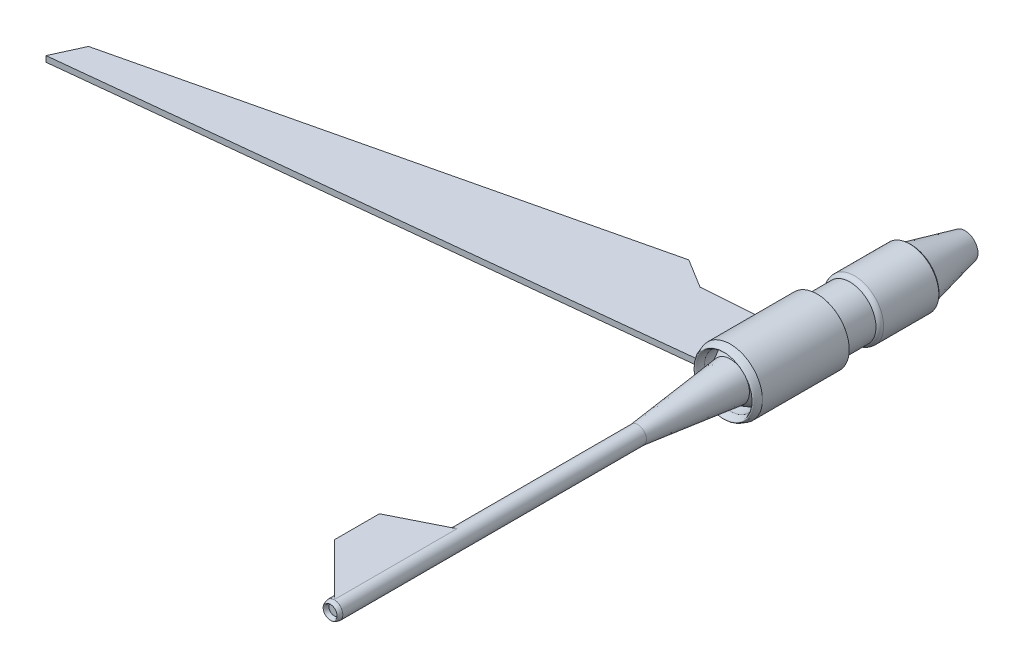
ISO-10303-21;
HEADER;
FILE_DESCRIPTION(('STEP AP214'),'2;1');
FILE_NAME('part.step','',(''),(''),'','','');
FILE_SCHEMA(('AUTOMOTIVE_DESIGN { 1 0 10303 214 1 1 1 1 }'));
ENDSEC;
DATA;
#1=APPLICATION_CONTEXT('core data for automotive mechanical design processes');
#2=APPLICATION_PROTOCOL_DEFINITION('international standard','automotive_design',2000,#1);
#3=PRODUCT_CONTEXT('',#1,'mechanical');
#4=PRODUCT('Part','Part','',(#3));
#5=PRODUCT_RELATED_PRODUCT_CATEGORY('part','',(#4));
#6=PRODUCT_DEFINITION_FORMATION('','',#4);
#7=PRODUCT_DEFINITION_CONTEXT('part definition',#1,'design');
#8=PRODUCT_DEFINITION('design','',#6,#7);
#9=PRODUCT_DEFINITION_SHAPE('','',#8);
#10=(LENGTH_UNIT() NAMED_UNIT(*) SI_UNIT(.MILLI.,.METRE.));
#11=(NAMED_UNIT(*) PLANE_ANGLE_UNIT() SI_UNIT($,.RADIAN.));
#12=(NAMED_UNIT(*) SI_UNIT($,.STERADIAN.) SOLID_ANGLE_UNIT());
#13=UNCERTAINTY_MEASURE_WITH_UNIT(LENGTH_MEASURE(1.E-05),#10,'distance_accuracy_value','');
#14=(GEOMETRIC_REPRESENTATION_CONTEXT(3) GLOBAL_UNCERTAINTY_ASSIGNED_CONTEXT((#13)) GLOBAL_UNIT_ASSIGNED_CONTEXT((#10,
#11,#12)) REPRESENTATION_CONTEXT('',''));
#15=CARTESIAN_POINT('',(0.,0.,0.));
#16=DIRECTION('',(0.,0.,1.));
#17=DIRECTION('',(1.,0.,0.));
#18=AXIS2_PLACEMENT_3D('',#15,#16,#17);
#19=CARTESIAN_POINT('',(0.,0.,-1125.));
#20=DIRECTION('',(0.,0.,1.));
#21=DIRECTION('',(1.,0.,0.));
#22=AXIS2_PLACEMENT_3D('',#19,#20,#21);
#23=CYLINDRICAL_SURFACE('',#22,337.5);
#24=CARTESIAN_POINT('',(0.,0.,-306.632414300902));
#25=DIRECTION('',(0.,0.,1.));
#26=DIRECTION('',(1.,0.,0.));
#27=AXIS2_PLACEMENT_3D('',#24,#25,#26);
#28=CIRCLE('',#27,337.5);
#29=CARTESIAN_POINT('',(337.5,0.,-306.632414300902));
#30=VERTEX_POINT('',#29);
#31=EDGE_CURVE('P0_E26',#30,#30,#28,.F.);
#32=ORIENTED_EDGE('',*,*,#31,.F.);
#33=EDGE_LOOP('',(#32));
#34=FACE_BOUND('',#33,.T.);
#35=CARTESIAN_POINT('',(0.,0.,-1125.));
#36=DIRECTION('',(0.,0.,-1.));
#37=DIRECTION('',(-1.,0.,0.));
#38=AXIS2_PLACEMENT_3D('',#35,#36,#37);
#39=CIRCLE('',#38,337.5);
#40=CARTESIAN_POINT('',(-337.5,0.,-1125.));
#41=VERTEX_POINT('',#40);
#42=EDGE_CURVE('P0_E22',#41,#41,#39,.F.);
#43=ORIENTED_EDGE('',*,*,#42,.F.);
#44=EDGE_LOOP('',(#43));
#45=FACE_BOUND('',#44,.T.);
#46=ADVANCED_FACE('P0_F15',(#34,#45),#23,.F.);
#47=CARTESIAN_POINT('',(0.,0.,0.));
#48=DIRECTION('',(0.,0.,1.));
#49=DIRECTION('',(1.,0.,0.));
#50=AXIS2_PLACEMENT_3D('',#47,#48,#49);
#51=CIRCLE('',#50,337.5);
#52=CARTESIAN_POINT('',(337.5,0.,0.));
#53=VERTEX_POINT('',#52);
#54=EDGE_CURVE('P0_E38',#53,#53,#51,.T.);
#55=ORIENTED_EDGE('',*,*,#54,.T.);
#56=EDGE_LOOP('',(#55));
#57=FACE_BOUND('',#56,.T.);
#58=CARTESIAN_POINT('',(0.,0.,-163.537287627148));
#59=DIRECTION('',(0.,0.,-1.));
#60=DIRECTION('',(-1.,0.,0.));
#61=AXIS2_PLACEMENT_3D('',#58,#59,#60);
#62=CIRCLE('',#61,337.5);
#63=CARTESIAN_POINT('',(-337.5,0.,-163.537287627148));
#64=VERTEX_POINT('',#63);
#65=EDGE_CURVE('P0_E30',#64,#64,#62,.F.);
#66=ORIENTED_EDGE('',*,*,#65,.F.);
#67=EDGE_LOOP('',(#66));
#68=FACE_BOUND('',#67,.T.);
#69=ADVANCED_FACE('P0_F59',(#57,#68),#23,.F.);
#70=CARTESIAN_POINT('',(0.,0.,-1125.));
#71=DIRECTION('',(0.,0.,1.));
#72=DIRECTION('',(1.,0.,0.));
#73=AXIS2_PLACEMENT_3D('',#70,#71,#72);
#74=CYLINDRICAL_SURFACE('',#73,416.25);
#75=CARTESIAN_POINT('',(0.,0.,-1125.));
#76=DIRECTION('',(0.,0.,1.));
#77=DIRECTION('',(1.,0.,0.));
#78=AXIS2_PLACEMENT_3D('',#75,#76,#77);
#79=CIRCLE('',#78,416.25);
#80=CARTESIAN_POINT('',(416.25,0.,-1125.));
#81=VERTEX_POINT('',#80);
#82=EDGE_CURVE('P0_E94',#81,#81,#79,.T.);
#83=ORIENTED_EDGE('',*,*,#82,.T.);
#84=EDGE_LOOP('',(#83));
#85=FACE_BOUND('',#84,.T.);
#86=CARTESIAN_POINT('',(0.,0.,0.));
#87=DIRECTION('',(0.,0.,1.));
#88=DIRECTION('',(1.,0.,0.));
#89=AXIS2_PLACEMENT_3D('',#86,#87,#88);
#90=CIRCLE('',#89,416.25);
#91=CARTESIAN_POINT('',(416.25,0.,0.));
#92=VERTEX_POINT('',#91);
#93=EDGE_CURVE('P0_E35',#92,#92,#90,.T.);
#94=ORIENTED_EDGE('',*,*,#93,.F.);
#95=EDGE_LOOP('',(#94));
#96=FACE_BOUND('',#95,.T.);
#97=ADVANCED_FACE('P0_F17',(#85,#96),#74,.T.);
#98=CARTESIAN_POINT('',(0.,416.25,0.));
#99=CARTESIAN_POINT('',(0.,376.875,180.));
#100=CARTESIAN_POINT('',(0.,337.5,0.));
#101=B_SPLINE_CURVE_WITH_KNOTS('',2,(#98,#99,#100),.UNSPECIFIED.,.F.,.F.,(3,3),(0.,1.),.UNSPECIFIED.);
#102=CARTESIAN_POINT('',(0.,0.,0.));
#103=DIRECTION('',(0.,0.,1.));
#104=AXIS1_PLACEMENT('',#102,#103);
#105=SURFACE_OF_REVOLUTION('',#101,#104);
#106=ORIENTED_EDGE('',*,*,#54,.F.);
#107=EDGE_LOOP('',(#106));
#108=FACE_BOUND('',#107,.T.);
#109=ORIENTED_EDGE('',*,*,#93,.T.);
#110=EDGE_LOOP('',(#109));
#111=FACE_BOUND('',#110,.T.);
#112=ADVANCED_FACE('P0_F51',(#108,#111),#105,.T.);
#113=CARTESIAN_POINT('',(0.,247.5,-306.632414300902));
#114=DIRECTION('',(0.,0.,1.));
#115=DIRECTION('',(1.,0.,0.));
#116=AXIS2_PLACEMENT_3D('',#113,#114,#115);
#117=PLANE('',#116);
#118=CARTESIAN_POINT('',(0.,0.,-306.632414300902));
#119=DIRECTION('',(0.,0.,1.));
#120=DIRECTION('',(1.,0.,0.));
#121=AXIS2_PLACEMENT_3D('',#118,#119,#120);
#122=CIRCLE('',#121,247.5);
#123=CARTESIAN_POINT('',(247.5,0.,-306.632414300902));
#124=VERTEX_POINT('',#123);
#125=EDGE_CURVE('P0_E41',#124,#124,#122,.T.);
#126=ORIENTED_EDGE('',*,*,#125,.T.);
#127=EDGE_LOOP('',(#126));
#128=FACE_BOUND('',#127,.T.);
#129=ORIENTED_EDGE('',*,*,#31,.T.);
#130=EDGE_LOOP('',(#129));
#131=FACE_BOUND('',#130,.T.);
#132=ADVANCED_FACE('P0_F54',(#128,#131),#117,.F.);
#133=CARTESIAN_POINT('',(0.,0.,-306.632414300902));
#134=DIRECTION('',(0.,0.,-1.));
#135=DIRECTION('',(-1.,0.,0.));
#136=AXIS2_PLACEMENT_3D('',#133,#134,#135);
#137=CONICAL_SURFACE('',#136,416.25,0.503098996215438);
#138=CARTESIAN_POINT('',(0.,0.,0.));
#139=DIRECTION('',(0.,0.,1.));
#140=DIRECTION('',(1.,0.,0.));
#141=AXIS2_PLACEMENT_3D('',#138,#139,#140);
#142=CIRCLE('',#141,247.5);
#143=CARTESIAN_POINT('',(247.5,0.,0.));
#144=VERTEX_POINT('',#143);
#145=EDGE_CURVE('P0_E99',#144,#144,#142,.T.);
#146=ORIENTED_EDGE('',*,*,#145,.F.);
#147=EDGE_LOOP('',(#146));
#148=FACE_BOUND('',#147,.T.);
#149=ORIENTED_EDGE('',*,*,#65,.T.);
#150=EDGE_LOOP('',(#149));
#151=FACE_BOUND('',#150,.T.);
#152=ADVANCED_FACE('P0_F70',(#148,#151),#137,.T.);
#153=CARTESIAN_POINT('',(0.,0.,0.));
#154=DIRECTION('',(0.,0.,1.));
#155=DIRECTION('',(1.,0.,0.));
#156=AXIS2_PLACEMENT_3D('',#153,#154,#155);
#157=CYLINDRICAL_SURFACE('',#156,247.5);
#158=ORIENTED_EDGE('',*,*,#125,.F.);
#159=EDGE_LOOP('',(#158));
#160=FACE_BOUND('',#159,.T.);
#161=ORIENTED_EDGE('',*,*,#145,.T.);
#162=EDGE_LOOP('',(#161));
#163=FACE_BOUND('',#162,.T.);
#164=ADVANCED_FACE('P0_F56',(#160,#163),#157,.F.);
#165=CARTESIAN_POINT('',(0.,337.5,-1155.));
#166=CARTESIAN_POINT('',(0.,382.589285714286,-1155.));
#167=CARTESIAN_POINT('',(0.,416.25,-1125.));
#168=(BOUNDED_CURVE() B_SPLINE_CURVE(2,(#165,#166,#167),.UNSPECIFIED.,.F.,
.F.) B_SPLINE_CURVE_WITH_KNOTS((3,3),(0.,1.),
.UNSPECIFIED.) CURVE() GEOMETRIC_REPRESENTATION_ITEM() RATIONAL_B_SPLINE_CURVE((1.,
0.806097205553273,1.)) REPRESENTATION_ITEM(''));
#169=CARTESIAN_POINT('',(0.,0.,-1125.));
#170=DIRECTION('',(0.,0.,1.));
#171=AXIS1_PLACEMENT('',#169,#170);
#172=SURFACE_OF_REVOLUTION('',#168,#171);
#173=ORIENTED_EDGE('',*,*,#82,.F.);
#174=EDGE_LOOP('',(#173));
#175=FACE_BOUND('',#174,.T.);
#176=CARTESIAN_POINT('',(0.,0.,-1155.));
#177=DIRECTION('',(0.,0.,1.));
#178=DIRECTION('',(1.,0.,0.));
#179=AXIS2_PLACEMENT_3D('',#176,#177,#178);
#180=CIRCLE('',#179,337.5);
#181=CARTESIAN_POINT('',(337.5,0.,-1155.));
#182=VERTEX_POINT('',#181);
#183=EDGE_CURVE('P0_E92',#182,#182,#180,.F.);
#184=ORIENTED_EDGE('',*,*,#183,.F.);
#185=EDGE_LOOP('',(#184));
#186=FACE_BOUND('',#185,.T.);
#187=ADVANCED_FACE('P0_F79',(#175,#186),#172,.T.);
#188=CARTESIAN_POINT('',(0.,0.,-1614.96422928336));
#189=DIRECTION('',(0.,0.,-1.));
#190=DIRECTION('',(-1.,0.,0.));
#191=AXIS2_PLACEMENT_3D('',#188,#189,#190);
#192=TOROIDAL_SURFACE('',#191,305.432483949171,71.5524158465949);
#193=CARTESIAN_POINT('',(0.,0.,-1611.));
#194=DIRECTION('',(0.,0.,-1.));
#195=DIRECTION('',(-1.,0.,0.));
#196=AXIS2_PLACEMENT_3D('',#193,#194,#195);
#197=CIRCLE('',#196,376.875);
#198=CARTESIAN_POINT('',(-376.875,0.,-1611.));
#199=VERTEX_POINT('',#198);
#200=EDGE_CURVE('P0_E247',#199,#199,#197,.T.);
#201=ORIENTED_EDGE('',*,*,#200,.F.);
#202=EDGE_LOOP('',(#201));
#203=FACE_BOUND('',#202,.T.);
#204=CARTESIAN_POINT('',(0.,0.,-1551.));
#205=DIRECTION('',(0.,0.,-1.));
#206=DIRECTION('',(-1.,0.,0.));
#207=AXIS2_PLACEMENT_3D('',#204,#205,#206);
#208=CIRCLE('',#207,337.5);
#209=CARTESIAN_POINT('',(-337.5,0.,-1551.));
#210=VERTEX_POINT('',#209);
#211=EDGE_CURVE('P0_E236',#210,#210,#208,.T.);
#212=ORIENTED_EDGE('',*,*,#211,.T.);
#213=EDGE_LOOP('',(#212));
#214=FACE_BOUND('',#213,.T.);
#215=ADVANCED_FACE('P0_F83',(#203,#214),#192,.T.);
#216=CARTESIAN_POINT('',(0.,0.,-2327.));
#217=DIRECTION('',(0.,0.,1.));
#218=DIRECTION('',(1.,0.,0.));
#219=AXIS2_PLACEMENT_3D('',#216,#217,#218);
#220=CYLINDRICAL_SURFACE('',#219,376.875);
#221=CARTESIAN_POINT('',(0.,0.,-2327.));
#222=DIRECTION('',(0.,0.,-1.));
#223=DIRECTION('',(-1.,0.,0.));
#224=AXIS2_PLACEMENT_3D('',#221,#222,#223);
#225=CIRCLE('',#224,376.875);
#226=CARTESIAN_POINT('',(-376.875,0.,-2327.));
#227=VERTEX_POINT('',#226);
#228=EDGE_CURVE('P0_E238',#227,#227,#225,.T.);
#229=ORIENTED_EDGE('',*,*,#228,.F.);
#230=EDGE_LOOP('',(#229));
#231=FACE_BOUND('',#230,.T.);
#232=ORIENTED_EDGE('',*,*,#200,.T.);
#233=EDGE_LOOP('',(#232));
#234=FACE_BOUND('',#233,.T.);
#235=ADVANCED_FACE('P0_F125',(#231,#234),#220,.T.);
#236=CARTESIAN_POINT('',(0.,0.,-1611.));
#237=DIRECTION('',(0.,0.,1.));
#238=DIRECTION('',(1.,0.,0.));
#239=AXIS2_PLACEMENT_3D('',#236,#237,#238);
#240=CYLINDRICAL_SURFACE('',#239,337.5);
#241=ORIENTED_EDGE('',*,*,#211,.F.);
#242=EDGE_LOOP('',(#241));
#243=FACE_BOUND('',#242,.T.);
#244=ORIENTED_EDGE('',*,*,#183,.T.);
#245=EDGE_LOOP('',(#244));
#246=FACE_BOUND('',#245,.T.);
#247=ADVANCED_FACE('P0_F85',(#243,#246),#240,.T.);
#248=CARTESIAN_POINT('',(0.,0.,-1125.));
#249=DIRECTION('',(0.,0.,-1.));
#250=DIRECTION('',(-1.,0.,0.));
#251=AXIS2_PLACEMENT_3D('',#248,#249,#250);
#252=PLANE('',#251);
#253=ORIENTED_EDGE('',*,*,#42,.T.);
#254=EDGE_LOOP('',(#253));
#255=FACE_BOUND('',#254,.T.);
#256=ADVANCED_FACE('P0_F142',(#255),#252,.F.);
#257=CARTESIAN_POINT('',(0.,330.618023233874,-2356.19997253065));
#258=CARTESIAN_POINT('',(0.,357.1875,-2356.19997253065));
#259=CARTESIAN_POINT('',(0.,376.875,-2327.));
#260=(BOUNDED_CURVE() B_SPLINE_CURVE(2,(#257,#258,#259),.UNSPECIFIED.,.F.,
.F.) B_SPLINE_CURVE_WITH_KNOTS((3,3),(0.,1.),
.UNSPECIFIED.) CURVE() GEOMETRIC_REPRESENTATION_ITEM() RATIONAL_B_SPLINE_CURVE((1.,
0.829833158093808,1.)) REPRESENTATION_ITEM(''));
#261=CARTESIAN_POINT('',(0.,0.,-2327.));
#262=DIRECTION('',(0.,0.,1.));
#263=AXIS1_PLACEMENT('',#261,#262);
#264=SURFACE_OF_REVOLUTION('',#260,#263);
#265=ORIENTED_EDGE('',*,*,#228,.T.);
#266=EDGE_LOOP('',(#265));
#267=FACE_BOUND('',#266,.T.);
#268=CARTESIAN_POINT('',(0.,0.,-2356.19997253065));
#269=DIRECTION('',(0.,0.,1.));
#270=DIRECTION('',(1.,0.,0.));
#271=AXIS2_PLACEMENT_3D('',#268,#269,#270);
#272=CIRCLE('',#271,330.618023233874);
#273=CARTESIAN_POINT('',(330.618023233874,0.,-2356.19997253065));
#274=VERTEX_POINT('',#273);
#275=EDGE_CURVE('P0_E10',#274,#274,#272,.T.);
#276=ORIENTED_EDGE('',*,*,#275,.T.);
#277=EDGE_LOOP('',(#276));
#278=FACE_BOUND('',#277,.T.);
#279=ADVANCED_FACE('P0_F150',(#267,#278),#264,.T.);
#280=CARTESIAN_POINT('',(0.,0.,-3043.));
#281=DIRECTION('',(0.,0.,1.));
#282=DIRECTION('',(1.,0.,0.));
#283=AXIS2_PLACEMENT_3D('',#280,#281,#282);
#284=PLANE('',#283);
#285=CARTESIAN_POINT('',(0.,0.,-3043.));
#286=DIRECTION('',(0.,0.,1.));
#287=DIRECTION('',(1.,0.,0.));
#288=AXIS2_PLACEMENT_3D('',#285,#286,#287);
#289=CIRCLE('',#288,168.75);
#290=CARTESIAN_POINT('',(168.75,0.,-3043.));
#291=VERTEX_POINT('',#290);
#292=EDGE_CURVE('P0_E242',#291,#291,#289,.T.);
#293=ORIENTED_EDGE('',*,*,#292,.F.);
#294=EDGE_LOOP('',(#293));
#295=FACE_BOUND('',#294,.T.);
#296=ADVANCED_FACE('P0_F157',(#295),#284,.F.);
#297=CARTESIAN_POINT('',(0.,0.,-3043.));
#298=DIRECTION('',(0.,0.,1.));
#299=DIRECTION('',(1.,0.,0.));
#300=AXIS2_PLACEMENT_3D('',#297,#298,#299);
#301=CONICAL_SURFACE('',#300,168.75,0.231460403304214);
#302=ORIENTED_EDGE('',*,*,#292,.T.);
#303=EDGE_LOOP('',(#302));
#304=FACE_BOUND('',#303,.T.);
#305=ORIENTED_EDGE('',*,*,#275,.F.);
#306=EDGE_LOOP('',(#305));
#307=FACE_BOUND('',#306,.T.);
#308=ADVANCED_FACE('P0_F166',(#304,#307),#301,.T.);
#309=CLOSED_SHELL('',(#46,#69,#97,#112,#132,#152,#164,#187,#215,#235,#247,#256,#279,#296,#308));
#310=MANIFOLD_SOLID_BREP('P0_B1',#309);
#311=CARTESIAN_POINT('',(1.46957615897682E-13,0.,5137.5));
#312=DIRECTION('',(0.,0.,-1.));
#313=DIRECTION('',(-1.,0.,0.));
#314=AXIS2_PLACEMENT_3D('',#311,#312,#313);
#315=CYLINDRICAL_SURFACE('',#314,112.5);
#316=CARTESIAN_POINT('',(1.46957615897682E-13,0.,3540.88446251693));
#317=DIRECTION('',(-0.447213595499958,0.,-0.894427190999916));
#318=DIRECTION('',(0.894427190999916,0.,-0.447213595499958));
#319=AXIS2_PLACEMENT_3D('',#316,#317,#318);
#320=ELLIPSE('',#319,125.778823734363,112.5);
#321=CARTESIAN_POINT('',(-93.5507258153162,62.4860920479709,3587.65982542459));
#322=VERTEX_POINT('',#321);
#323=CARTESIAN_POINT('',(-1.76892503385784,112.486092047971,3541.76892503386));
#324=VERTEX_POINT('',#323);
#325=EDGE_CURVE('P1_E11',#322,#324,#320,.T.);
#326=ORIENTED_EDGE('',*,*,#325,.T.);
#327=DIRECTION('',(0.,0.,-1.));
#328=VECTOR('',#327,1.);
#329=CARTESIAN_POINT('',(-1.76892503385783,112.486092047971,5137.5));
#330=LINE('',#329,#328);
#331=CARTESIAN_POINT('',(-1.76892503385784,112.486092047971,5133.96214993228));
#332=VERTEX_POINT('',#331);
#333=EDGE_CURVE('P1_E38',#324,#332,#330,.F.);
#334=ORIENTED_EDGE('',*,*,#333,.T.);
#335=CARTESIAN_POINT('',(1.46957615897682E-13,0.,5135.73107496614));
#336=DIRECTION('',(-0.707106781186547,0.,0.707106781186548));
#337=DIRECTION('',(-0.707106781186548,0.,-0.707106781186547));
#338=AXIS2_PLACEMENT_3D('',#335,#336,#337);
#339=ELLIPSE('',#338,159.099025766973,112.5);
#340=CARTESIAN_POINT('',(-93.5507258153162,62.4860920479709,5042.18034915083));
#341=VERTEX_POINT('',#340);
#342=EDGE_CURVE('P1_E88',#332,#341,#339,.T.);
#343=ORIENTED_EDGE('',*,*,#342,.T.);
#344=DIRECTION('',(0.,0.,-1.));
#345=VECTOR('',#344,1.);
#346=CARTESIAN_POINT('',(-93.5507258153162,62.4860920479709,5137.5));
#347=LINE('',#346,#345);
#348=EDGE_CURVE('P1_E85',#322,#341,#347,.F.);
#349=ORIENTED_EDGE('',*,*,#348,.F.);
#350=EDGE_LOOP('',(#326,#334,#343,#349));
#351=FACE_BOUND('',#350,.T.);
#352=CARTESIAN_POINT('',(1.46957615897682E-13,0.,1200.));
#353=DIRECTION('',(0.,0.,1.));
#354=DIRECTION('',(1.,0.,0.));
#355=AXIS2_PLACEMENT_3D('',#352,#353,#354);
#356=CIRCLE('',#355,112.5);
#357=CARTESIAN_POINT('',(112.5,0.,1200.));
#358=VERTEX_POINT('',#357);
#359=EDGE_CURVE('P1_E135',#358,#358,#356,.T.);
#360=ORIENTED_EDGE('',*,*,#359,.T.);
#361=EDGE_LOOP('',(#360));
#362=FACE_BOUND('',#361,.T.);
#363=CARTESIAN_POINT('',(1.46957615897682E-13,0.,5137.5));
#364=DIRECTION('',(0.,0.,1.));
#365=DIRECTION('',(1.,0.,0.));
#366=AXIS2_PLACEMENT_3D('',#363,#364,#365);
#367=CIRCLE('',#366,112.5);
#368=CARTESIAN_POINT('',(112.5,0.,5137.5));
#369=VERTEX_POINT('',#368);
#370=EDGE_CURVE('P1_E137',#369,#369,#367,.T.);
#371=ORIENTED_EDGE('',*,*,#370,.F.);
#372=EDGE_LOOP('',(#371));
#373=FACE_BOUND('',#372,.T.);
#374=ADVANCED_FACE('P1_F17',(#351,#362,#373),#315,.T.);
#375=CARTESIAN_POINT('',(0.,0.,0.));
#376=DIRECTION('',(0.,0.,1.));
#377=DIRECTION('',(1.,0.,0.));
#378=AXIS2_PLACEMENT_3D('',#375,#376,#377);
#379=PLANE('',#378);
#380=CARTESIAN_POINT('',(0.,0.,0.));
#381=DIRECTION('',(0.,0.,-1.));
#382=DIRECTION('',(-1.,0.,0.));
#383=AXIS2_PLACEMENT_3D('',#380,#381,#382);
#384=CIRCLE('',#383,247.5);
#385=CARTESIAN_POINT('',(-247.5,0.,0.));
#386=VERTEX_POINT('',#385);
#387=EDGE_CURVE('P1_E26',#386,#386,#384,.T.);
#388=ORIENTED_EDGE('',*,*,#387,.T.);
#389=EDGE_LOOP('',(#388));
#390=FACE_BOUND('',#389,.T.);
#391=ADVANCED_FACE('P1_F19',(#390),#379,.F.);
#392=CARTESIAN_POINT('',(1.46957615897682E-13,0.,1200.));
#393=DIRECTION('',(0.,0.,-1.));
#394=DIRECTION('',(-1.,0.,0.));
#395=AXIS2_PLACEMENT_3D('',#392,#393,#394);
#396=CONICAL_SURFACE('',#395,112.5,0.112028962425988);
#397=ORIENTED_EDGE('',*,*,#387,.F.);
#398=EDGE_LOOP('',(#397));
#399=FACE_BOUND('',#398,.T.);
#400=ORIENTED_EDGE('',*,*,#359,.F.);
#401=EDGE_LOOP('',(#400));
#402=FACE_BOUND('',#401,.T.);
#403=ADVANCED_FACE('P1_F113',(#399,#402),#396,.T.);
#404=CARTESIAN_POINT('',(0.,67.5,5137.5));
#405=CARTESIAN_POINT('',(0.,90.,5237.5));
#406=CARTESIAN_POINT('',(0.,112.5,5137.5));
#407=B_SPLINE_CURVE_WITH_KNOTS('',2,(#404,#405,#406),.UNSPECIFIED.,.F.,.F.,(3,3),(0.,1.),.UNSPECIFIED.);
#408=CARTESIAN_POINT('',(0.,0.,5137.5));
#409=DIRECTION('',(0.,0.,-1.));
#410=AXIS1_PLACEMENT('',#408,#409);
#411=SURFACE_OF_REVOLUTION('',#407,#410);
#412=ORIENTED_EDGE('',*,*,#370,.T.);
#413=EDGE_LOOP('',(#412));
#414=FACE_BOUND('',#413,.T.);
#415=CARTESIAN_POINT('',(0.,0.,5137.5));
#416=DIRECTION('',(0.,0.,-1.));
#417=DIRECTION('',(0.,1.,0.));
#418=AXIS2_PLACEMENT_3D('',#415,#416,#417);
#419=CIRCLE('',#418,67.5);
#420=CARTESIAN_POINT('',(0.,67.5,5137.5));
#421=VERTEX_POINT('',#420);
#422=EDGE_CURVE('P1_E95',#421,#421,#419,.T.);
#423=ORIENTED_EDGE('',*,*,#422,.T.);
#424=EDGE_LOOP('',(#423));
#425=FACE_BOUND('',#424,.T.);
#426=ADVANCED_FACE('P1_F108',(#414,#425),#411,.T.);
#427=CARTESIAN_POINT('',(1.46957615897682E-13,0.,5137.5));
#428=DIRECTION('',(0.,0.,1.));
#429=DIRECTION('',(1.,0.,0.));
#430=AXIS2_PLACEMENT_3D('',#427,#428,#429);
#431=PLANE('',#430);
#432=ORIENTED_EDGE('',*,*,#422,.F.);
#433=EDGE_LOOP('',(#432));
#434=FACE_BOUND('',#433,.T.);
#435=ADVANCED_FACE('P1_F112',(#434),#431,.T.);
#436=CARTESIAN_POINT('',(0.,112.486092047971,0.));
#437=DIRECTION('',(0.,1.,0.));
#438=DIRECTION('',(0.,0.,1.));
#439=AXIS2_PLACEMENT_3D('',#436,#437,#438);
#440=PLANE('',#439);
#441=ORIENTED_EDGE('',*,*,#333,.F.);
#442=DIRECTION('',(-0.894427190999916,0.,0.447213595499958));
#443=VECTOR('',#442,1.);
#444=CARTESIAN_POINT('',(-673.231074966143,112.486092047971,3877.5));
#445=LINE('',#444,#443);
#446=CARTESIAN_POINT('',(-673.231074966143,112.486092047971,3877.5));
#447=VERTEX_POINT('',#446);
#448=EDGE_CURVE('P1_E83',#324,#447,#445,.T.);
#449=ORIENTED_EDGE('',*,*,#448,.T.);
#450=DIRECTION('',(0.,0.,1.));
#451=VECTOR('',#450,1.);
#452=CARTESIAN_POINT('',(-673.231074966143,112.486092047971,4462.5));
#453=LINE('',#452,#451);
#454=CARTESIAN_POINT('',(-673.231074966143,112.486092047971,4462.5));
#455=VERTEX_POINT('',#454);
#456=EDGE_CURVE('P1_E73',#447,#455,#453,.T.);
#457=ORIENTED_EDGE('',*,*,#456,.T.);
#458=DIRECTION('',(0.707106781186548,0.,0.707106781186547));
#459=VECTOR('',#458,1.);
#460=CARTESIAN_POINT('',(-673.231074966143,112.486092047971,4462.5));
#461=LINE('',#460,#459);
#462=EDGE_CURVE('P1_E33',#455,#332,#461,.T.);
#463=ORIENTED_EDGE('',*,*,#462,.T.);
#464=EDGE_LOOP('',(#441,#449,#457,#463));
#465=FACE_BOUND('',#464,.T.);
#466=ADVANCED_FACE('P1_F119',(#465),#440,.T.);
#467=CARTESIAN_POINT('',(-673.231074966143,62.4860920479709,4462.5));
#468=DIRECTION('',(-0.707106781186547,0.,0.707106781186548));
#469=DIRECTION('',(0.707106781186548,0.,0.707106781186547));
#470=AXIS2_PLACEMENT_3D('',#467,#468,#469);
#471=PLANE('',#470);
#472=ORIENTED_EDGE('',*,*,#342,.F.);
#473=ORIENTED_EDGE('',*,*,#462,.F.);
#474=DIRECTION('',(0.,1.,0.));
#475=VECTOR('',#474,1.);
#476=CARTESIAN_POINT('',(-673.231074966143,62.4860920479709,4462.5));
#477=LINE('',#476,#475);
#478=CARTESIAN_POINT('',(-673.231074966143,62.4860920479709,4462.5));
#479=VERTEX_POINT('',#478);
#480=EDGE_CURVE('P1_E74',#479,#455,#477,.T.);
#481=ORIENTED_EDGE('',*,*,#480,.F.);
#482=DIRECTION('',(0.707106781186548,0.,0.707106781186547));
#483=VECTOR('',#482,1.);
#484=CARTESIAN_POINT('',(-673.231074966143,62.4860920479709,4462.5));
#485=LINE('',#484,#483);
#486=EDGE_CURVE('P1_E68',#479,#341,#485,.T.);
#487=ORIENTED_EDGE('',*,*,#486,.T.);
#488=EDGE_LOOP('',(#472,#473,#481,#487));
#489=FACE_BOUND('',#488,.T.);
#490=ADVANCED_FACE('P1_F115',(#489),#471,.T.);
#491=CARTESIAN_POINT('',(0.,62.4860920479709,0.));
#492=DIRECTION('',(0.,1.,0.));
#493=DIRECTION('',(0.,0.,1.));
#494=AXIS2_PLACEMENT_3D('',#491,#492,#493);
#495=PLANE('',#494);
#496=DIRECTION('',(-0.894427190999916,0.,0.447213595499958));
#497=VECTOR('',#496,1.);
#498=CARTESIAN_POINT('',(-673.231074966143,62.4860920479709,3877.5));
#499=LINE('',#498,#497);
#500=CARTESIAN_POINT('',(-673.231074966143,62.4860920479709,3877.5));
#501=VERTEX_POINT('',#500);
#502=EDGE_CURVE('P1_E59',#322,#501,#499,.T.);
#503=ORIENTED_EDGE('',*,*,#502,.F.);
#504=ORIENTED_EDGE('',*,*,#348,.T.);
#505=ORIENTED_EDGE('',*,*,#486,.F.);
#506=DIRECTION('',(0.,0.,1.));
#507=VECTOR('',#506,1.);
#508=CARTESIAN_POINT('',(-673.231074966143,62.4860920479709,4462.5));
#509=LINE('',#508,#507);
#510=EDGE_CURVE('P1_E67',#501,#479,#509,.T.);
#511=ORIENTED_EDGE('',*,*,#510,.F.);
#512=EDGE_LOOP('',(#503,#504,#505,#511));
#513=FACE_BOUND('',#512,.T.);
#514=ADVANCED_FACE('P1_F77',(#513),#495,.F.);
#515=CARTESIAN_POINT('',(-673.231074966143,62.4860920479709,4462.5));
#516=DIRECTION('',(-1.,0.,0.));
#517=DIRECTION('',(0.,0.,1.));
#518=AXIS2_PLACEMENT_3D('',#515,#516,#517);
#519=PLANE('',#518);
#520=ORIENTED_EDGE('',*,*,#456,.F.);
#521=DIRECTION('',(0.,1.,0.));
#522=VECTOR('',#521,1.);
#523=CARTESIAN_POINT('',(-673.231074966143,62.4860920479709,3877.5));
#524=LINE('',#523,#522);
#525=EDGE_CURVE('P1_E62',#501,#447,#524,.T.);
#526=ORIENTED_EDGE('',*,*,#525,.F.);
#527=ORIENTED_EDGE('',*,*,#510,.T.);
#528=ORIENTED_EDGE('',*,*,#480,.T.);
#529=EDGE_LOOP('',(#520,#526,#527,#528));
#530=FACE_BOUND('',#529,.T.);
#531=ADVANCED_FACE('P1_F72',(#530),#519,.T.);
#532=CARTESIAN_POINT('',(-673.231074966143,62.4860920479709,3877.5));
#533=DIRECTION('',(-0.447213595499958,0.,-0.894427190999916));
#534=DIRECTION('',(-0.894427190999916,0.,0.447213595499958));
#535=AXIS2_PLACEMENT_3D('',#532,#533,#534);
#536=PLANE('',#535);
#537=ORIENTED_EDGE('',*,*,#325,.F.);
#538=ORIENTED_EDGE('',*,*,#502,.T.);
#539=ORIENTED_EDGE('',*,*,#525,.T.);
#540=ORIENTED_EDGE('',*,*,#448,.F.);
#541=EDGE_LOOP('',(#537,#538,#539,#540));
#542=FACE_BOUND('',#541,.T.);
#543=ADVANCED_FACE('P1_F61',(#542),#536,.T.);
#544=CLOSED_SHELL('',(#374,#391,#403,#426,#435,#466,#490,#514,#531,#543));
#545=MANIFOLD_SOLID_BREP('P1_B1',#544);
#546=CARTESIAN_POINT('',(-416.249999999997,37.5,-880.992127793261));
#547=DIRECTION('',(-1.,0.,0.));
#548=DIRECTION('',(0.,0.,1.));
#549=AXIS2_PLACEMENT_3D('',#546,#547,#548);
#550=PLANE('',#549);
#551=DIRECTION('',(0.,0.,-1.));
#552=VECTOR('',#551,1.);
#553=CARTESIAN_POINT('',(-416.249999999997,-37.5,-880.992127793261));
#554=LINE('',#553,#552);
#555=CARTESIAN_POINT('',(-416.25,-37.5,2.71017206594245));
#556=VERTEX_POINT('',#555);
#557=CARTESIAN_POINT('',(-416.249999999997,-37.5,-880.992127793261));
#558=VERTEX_POINT('',#557);
#559=EDGE_CURVE('P2_E104',#556,#558,#554,.T.);
#560=ORIENTED_EDGE('',*,*,#559,.T.);
#561=DIRECTION('',(0.,-1.,0.));
#562=VECTOR('',#561,1.);
#563=CARTESIAN_POINT('',(-416.249999999997,37.5,-880.992127793261));
#564=LINE('',#563,#562);
#565=CARTESIAN_POINT('',(-416.249999999997,37.5,-880.992127793261));
#566=VERTEX_POINT('',#565);
#567=EDGE_CURVE('P2_E24',#566,#558,#564,.T.);
#568=ORIENTED_EDGE('',*,*,#567,.F.);
#569=DIRECTION('',(0.,0.,-1.));
#570=VECTOR('',#569,1.);
#571=CARTESIAN_POINT('',(-416.249999999997,37.5,-880.992127793261));
#572=LINE('',#571,#570);
#573=CARTESIAN_POINT('',(-416.25,37.5,2.71017206594245));
#574=VERTEX_POINT('',#573);
#575=EDGE_CURVE('P2_E70',#574,#566,#572,.T.);
#576=ORIENTED_EDGE('',*,*,#575,.F.);
#577=DIRECTION('',(0.,-1.,0.));
#578=VECTOR('',#577,1.);
#579=CARTESIAN_POINT('',(-416.25,37.5,2.71017206594245));
#580=LINE('',#579,#578);
#581=EDGE_CURVE('P2_E10',#574,#556,#580,.T.);
#582=ORIENTED_EDGE('',*,*,#581,.T.);
#583=EDGE_LOOP('',(#560,#568,#576,#582));
#584=FACE_BOUND('',#583,.T.);
#585=ADVANCED_FACE('P2_F16',(#584),#550,.F.);
#586=CARTESIAN_POINT('',(-1214.02221487271,37.5,-821.330639569457));
#587=DIRECTION('',(0.0745768602797542,0.,0.997215268590897));
#588=DIRECTION('',(0.997215268590897,0.,-0.0745768602797542));
#589=AXIS2_PLACEMENT_3D('',#586,#587,#588);
#590=PLANE('',#589);
#591=DIRECTION('',(-0.997215268590897,0.,0.0745768602797542));
#592=VECTOR('',#591,1.);
#593=CARTESIAN_POINT('',(-1214.02221487271,-37.5,-821.330639569457));
#594=LINE('',#593,#592);
#595=CARTESIAN_POINT('',(-1214.02221487271,-37.5,-821.330639569457));
#596=VERTEX_POINT('',#595);
#597=EDGE_CURVE('P2_E106',#558,#596,#594,.T.);
#598=ORIENTED_EDGE('',*,*,#597,.T.);
#599=DIRECTION('',(0.,-1.,0.));
#600=VECTOR('',#599,1.);
#601=CARTESIAN_POINT('',(-1214.02221487271,37.5,-821.330639569457));
#602=LINE('',#601,#600);
#603=CARTESIAN_POINT('',(-1214.02221487271,37.5,-821.330639569457));
#604=VERTEX_POINT('',#603);
#605=EDGE_CURVE('P2_E93',#604,#596,#602,.T.);
#606=ORIENTED_EDGE('',*,*,#605,.F.);
#607=DIRECTION('',(-0.997215268590897,0.,0.0745768602797542));
#608=VECTOR('',#607,1.);
#609=CARTESIAN_POINT('',(-1214.02221487271,37.5,-821.330639569457));
#610=LINE('',#609,#608);
#611=EDGE_CURVE('P2_E84',#566,#604,#610,.T.);
#612=ORIENTED_EDGE('',*,*,#611,.F.);
#613=ORIENTED_EDGE('',*,*,#567,.T.);
#614=EDGE_LOOP('',(#598,#606,#612,#613));
#615=FACE_BOUND('',#614,.T.);
#616=ADVANCED_FACE('P2_F118',(#615),#590,.F.);
#617=CARTESIAN_POINT('',(-1592.92388832591,37.5,-1054.69413683149));
#618=DIRECTION('',(-0.524412353397824,0.,0.851464434726287));
#619=DIRECTION('',(0.851464434726287,0.,0.524412353397824));
#620=AXIS2_PLACEMENT_3D('',#617,#618,#619);
#621=PLANE('',#620);
#622=DIRECTION('',(-0.851464434726287,0.,-0.524412353397824));
#623=VECTOR('',#622,1.);
#624=CARTESIAN_POINT('',(-1592.92388832591,-37.5,-1054.69413683149));
#625=LINE('',#624,#623);
#626=CARTESIAN_POINT('',(-1592.92388832591,-37.5,-1054.69413683149));
#627=VERTEX_POINT('',#626);
#628=EDGE_CURVE('P2_E92',#596,#627,#625,.T.);
#629=ORIENTED_EDGE('',*,*,#628,.T.);
#630=DIRECTION('',(0.,-1.,0.));
#631=VECTOR('',#630,1.);
#632=CARTESIAN_POINT('',(-1592.92388832591,37.5,-1054.69413683149));
#633=LINE('',#632,#631);
#634=CARTESIAN_POINT('',(-1592.92388832591,37.5,-1054.69413683149));
#635=VERTEX_POINT('',#634);
#636=EDGE_CURVE('P2_E89',#635,#627,#633,.T.);
#637=ORIENTED_EDGE('',*,*,#636,.F.);
#638=DIRECTION('',(-0.851464434726287,0.,-0.524412353397824));
#639=VECTOR('',#638,1.);
#640=CARTESIAN_POINT('',(-1592.92388832591,37.5,-1054.69413683149));
#641=LINE('',#640,#639);
#642=EDGE_CURVE('P2_E78',#604,#635,#641,.T.);
#643=ORIENTED_EDGE('',*,*,#642,.F.);
#644=ORIENTED_EDGE('',*,*,#605,.T.);
#645=EDGE_LOOP('',(#629,#637,#643,#644));
#646=FACE_BOUND('',#645,.T.);
#647=ADVANCED_FACE('P2_F90',(#646),#621,.F.);
#648=CARTESIAN_POINT('',(-7882.66942032056,37.5,440.406576416085));
#649=DIRECTION('',(0.231260744508519,0.,0.972891806959729));
#650=DIRECTION('',(0.972891806959729,0.,-0.231260744508519));
#651=AXIS2_PLACEMENT_3D('',#648,#649,#650);
#652=PLANE('',#651);
#653=DIRECTION('',(-0.972891806959728,0.,0.231260744508519));
#654=VECTOR('',#653,1.);
#655=CARTESIAN_POINT('',(-7882.66942032056,-37.5,440.406576416085));
#656=LINE('',#655,#654);
#657=CARTESIAN_POINT('',(-7882.66942032056,-37.5,440.406576416085));
#658=VERTEX_POINT('',#657);
#659=EDGE_CURVE('P2_E56',#627,#658,#656,.T.);
#660=ORIENTED_EDGE('',*,*,#659,.T.);
#661=DIRECTION('',(0.,-1.,0.));
#662=VECTOR('',#661,1.);
#663=CARTESIAN_POINT('',(-7882.66942032056,37.5,440.406576416085));
#664=LINE('',#663,#662);
#665=CARTESIAN_POINT('',(-7882.66942032056,37.5,440.406576416085));
#666=VERTEX_POINT('',#665);
#667=EDGE_CURVE('P2_E94',#666,#658,#664,.T.);
#668=ORIENTED_EDGE('',*,*,#667,.F.);
#669=DIRECTION('',(-0.972891806959728,0.,0.231260744508519));
#670=VECTOR('',#669,1.);
#671=CARTESIAN_POINT('',(-7882.66942032056,37.5,440.406576416085));
#672=LINE('',#671,#670);
#673=EDGE_CURVE('P2_E82',#635,#666,#672,.T.);
#674=ORIENTED_EDGE('',*,*,#673,.F.);
#675=ORIENTED_EDGE('',*,*,#636,.T.);
#676=EDGE_LOOP('',(#660,#668,#674,#675));
#677=FACE_BOUND('',#676,.T.);
#678=ADVANCED_FACE('P2_F96',(#677),#652,.F.);
#679=CARTESIAN_POINT('',(-8055.44608892165,37.5,819.104721760249));
#680=DIRECTION('',(0.909785334160154,0.,0.415079083726338));
#681=DIRECTION('',(0.415079083726338,0.,-0.909785334160154));
#682=AXIS2_PLACEMENT_3D('',#679,#680,#681);
#683=PLANE('',#682);
#684=DIRECTION('',(-0.415079083726338,0.,0.909785334160154));
#685=VECTOR('',#684,1.);
#686=CARTESIAN_POINT('',(-8055.44608892165,-37.5,819.104721760249));
#687=LINE('',#686,#685);
#688=CARTESIAN_POINT('',(-8055.44608892165,-37.5,819.104721760249));
#689=VERTEX_POINT('',#688);
#690=EDGE_CURVE('P2_E63',#658,#689,#687,.T.);
#691=ORIENTED_EDGE('',*,*,#690,.T.);
#692=DIRECTION('',(0.,-1.,0.));
#693=VECTOR('',#692,1.);
#694=CARTESIAN_POINT('',(-8055.44608892165,37.5,819.104721760249));
#695=LINE('',#694,#693);
#696=CARTESIAN_POINT('',(-8055.44608892165,37.5,819.104721760249));
#697=VERTEX_POINT('',#696);
#698=EDGE_CURVE('P2_E100',#697,#689,#695,.T.);
#699=ORIENTED_EDGE('',*,*,#698,.F.);
#700=DIRECTION('',(-0.415079083726338,0.,0.909785334160154));
#701=VECTOR('',#700,1.);
#702=CARTESIAN_POINT('',(-8055.44608892165,37.5,819.104721760249));
#703=LINE('',#702,#701);
#704=EDGE_CURVE('P2_E98',#666,#697,#703,.T.);
#705=ORIENTED_EDGE('',*,*,#704,.F.);
#706=ORIENTED_EDGE('',*,*,#667,.T.);
#707=EDGE_LOOP('',(#691,#699,#705,#706));
#708=FACE_BOUND('',#707,.T.);
#709=ADVANCED_FACE('P2_F124',(#708),#683,.F.);
#710=CARTESIAN_POINT('',(-518.364472391949,37.5,13.6230610316536));
#711=DIRECTION('',(-0.106264071336226,0.,-0.994337944133205));
#712=DIRECTION('',(-0.994337944133206,0.,0.106264071336226));
#713=AXIS2_PLACEMENT_3D('',#710,#711,#712);
#714=PLANE('',#713);
#715=DIRECTION('',(0.994337944133205,0.,-0.106264071336226));
#716=VECTOR('',#715,1.);
#717=CARTESIAN_POINT('',(-518.364472391949,-37.5,13.6230610316536));
#718=LINE('',#717,#716);
#719=EDGE_CURVE('P2_E111',#689,#556,#718,.T.);
#720=ORIENTED_EDGE('',*,*,#719,.T.);
#721=ORIENTED_EDGE('',*,*,#581,.F.);
#722=DIRECTION('',(0.994337944133205,0.,-0.106264071336226));
#723=VECTOR('',#722,1.);
#724=CARTESIAN_POINT('',(-518.364472391949,37.5,13.6230610316536));
#725=LINE('',#724,#723);
#726=EDGE_CURVE('P2_E32',#697,#574,#725,.T.);
#727=ORIENTED_EDGE('',*,*,#726,.F.);
#728=ORIENTED_EDGE('',*,*,#698,.T.);
#729=EDGE_LOOP('',(#720,#721,#727,#728));
#730=FACE_BOUND('',#729,.T.);
#731=ADVANCED_FACE('P2_F123',(#730),#714,.F.);
#732=CARTESIAN_POINT('',(-518.364472391949,37.5,13.6230610316536));
#733=DIRECTION('',(0.,-1.,0.));
#734=DIRECTION('',(0.,0.,-1.));
#735=AXIS2_PLACEMENT_3D('',#732,#733,#734);
#736=PLANE('',#735);
#737=ORIENTED_EDGE('',*,*,#726,.T.);
#738=ORIENTED_EDGE('',*,*,#575,.T.);
#739=ORIENTED_EDGE('',*,*,#611,.T.);
#740=ORIENTED_EDGE('',*,*,#642,.T.);
#741=ORIENTED_EDGE('',*,*,#673,.T.);
#742=ORIENTED_EDGE('',*,*,#704,.T.);
#743=EDGE_LOOP('',(#737,#738,#739,#740,#741,#742));
#744=FACE_BOUND('',#743,.T.);
#745=ADVANCED_FACE('P2_F80',(#744),#736,.F.);
#746=CARTESIAN_POINT('',(-518.364472391949,-37.5,13.6230610316536));
#747=DIRECTION('',(0.,-1.,0.));
#748=DIRECTION('',(0.,0.,-1.));
#749=AXIS2_PLACEMENT_3D('',#746,#747,#748);
#750=PLANE('',#749);
#751=ORIENTED_EDGE('',*,*,#559,.F.);
#752=ORIENTED_EDGE('',*,*,#719,.F.);
#753=ORIENTED_EDGE('',*,*,#690,.F.);
#754=ORIENTED_EDGE('',*,*,#659,.F.);
#755=ORIENTED_EDGE('',*,*,#628,.F.);
#756=ORIENTED_EDGE('',*,*,#597,.F.);
#757=EDGE_LOOP('',(#751,#752,#753,#754,#755,#756));
#758=FACE_BOUND('',#757,.T.);
#759=ADVANCED_FACE('P2_F121',(#758),#750,.T.);
#760=CLOSED_SHELL('',(#585,#616,#647,#678,#709,#731,#745,#759));
#761=MANIFOLD_SOLID_BREP('P2_B1',#760);
#762=ADVANCED_BREP_SHAPE_REPRESENTATION('',(#18,#310,#545,#761),#14);
#763=SHAPE_DEFINITION_REPRESENTATION(#9,#762);
ENDSEC;
END-ISO-10303-21;
